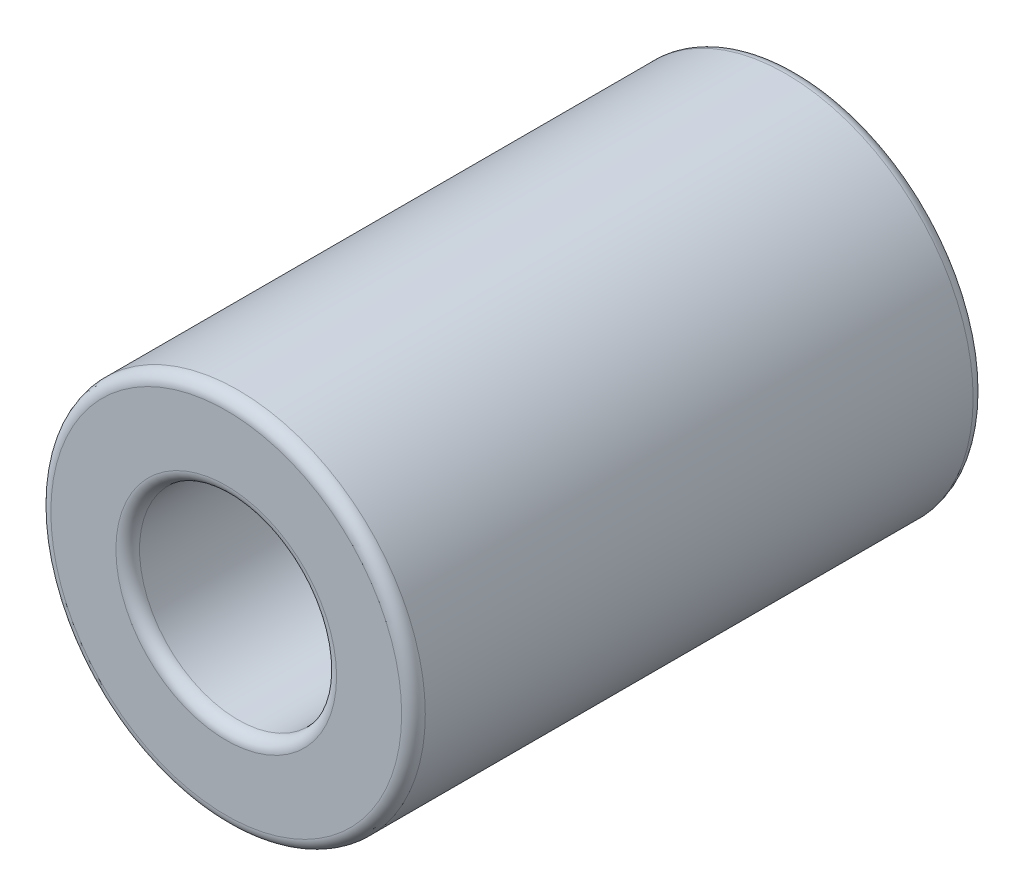
ISO-10303-21;
HEADER;
FILE_DESCRIPTION(('STEP AP214'),'2;1');
FILE_NAME('part.step','',(''),(''),'','','');
FILE_SCHEMA(('AUTOMOTIVE_DESIGN { 1 0 10303 214 1 1 1 1 }'));
ENDSEC;
DATA;
#1=APPLICATION_CONTEXT('core data for automotive mechanical design processes');
#2=APPLICATION_PROTOCOL_DEFINITION('international standard','automotive_design',2000,#1);
#3=PRODUCT_CONTEXT('',#1,'mechanical');
#4=PRODUCT('Part','Part','',(#3));
#5=PRODUCT_RELATED_PRODUCT_CATEGORY('part','',(#4));
#6=PRODUCT_DEFINITION_FORMATION('','',#4);
#7=PRODUCT_DEFINITION_CONTEXT('part definition',#1,'design');
#8=PRODUCT_DEFINITION('design','',#6,#7);
#9=PRODUCT_DEFINITION_SHAPE('','',#8);
#10=(LENGTH_UNIT() NAMED_UNIT(*) SI_UNIT(.MILLI.,.METRE.));
#11=(NAMED_UNIT(*) PLANE_ANGLE_UNIT() SI_UNIT($,.RADIAN.));
#12=(NAMED_UNIT(*) SI_UNIT($,.STERADIAN.) SOLID_ANGLE_UNIT());
#13=UNCERTAINTY_MEASURE_WITH_UNIT(LENGTH_MEASURE(1.E-05),#10,'distance_accuracy_value','');
#14=(GEOMETRIC_REPRESENTATION_CONTEXT(3) GLOBAL_UNCERTAINTY_ASSIGNED_CONTEXT((#13)) GLOBAL_UNIT_ASSIGNED_CONTEXT((#10,
#11,#12)) REPRESENTATION_CONTEXT('',''));
#15=CARTESIAN_POINT('',(0.,0.,0.));
#16=DIRECTION('',(0.,0.,1.));
#17=DIRECTION('',(1.,0.,0.));
#18=AXIS2_PLACEMENT_3D('',#15,#16,#17);
#19=CARTESIAN_POINT('',(0.,0.,29.));
#20=DIRECTION('',(0.,0.,1.));
#21=DIRECTION('',(1.,0.,0.));
#22=AXIS2_PLACEMENT_3D('',#19,#20,#21);
#23=PLANE('',#22);
#24=CARTESIAN_POINT('',(0.,0.,29.));
#25=DIRECTION('',(0.,0.,1.));
#26=DIRECTION('',(1.,0.,0.));
#27=AXIS2_PLACEMENT_3D('',#24,#25,#26);
#28=CIRCLE('',#27,5.6);
#29=CARTESIAN_POINT('',(5.6,0.,29.));
#30=VERTEX_POINT('',#29);
#31=EDGE_CURVE('E53',#30,#30,#28,.F.);
#32=ORIENTED_EDGE('',*,*,#31,.T.);
#33=EDGE_LOOP('',(#32));
#34=FACE_BOUND('',#33,.T.);
#35=CARTESIAN_POINT('',(0.,0.,29.));
#36=DIRECTION('',(0.,0.,1.));
#37=DIRECTION('',(1.,0.,0.));
#38=AXIS2_PLACEMENT_3D('',#35,#36,#37);
#39=CIRCLE('',#38,8.9);
#40=CARTESIAN_POINT('',(8.9,0.,29.));
#41=VERTEX_POINT('',#40);
#42=EDGE_CURVE('E56',#41,#41,#39,.T.);
#43=ORIENTED_EDGE('',*,*,#42,.T.);
#44=EDGE_LOOP('',(#43));
#45=FACE_BOUND('',#44,.T.);
#46=ADVANCED_FACE('F33',(#34,#45),#23,.T.);
#47=CARTESIAN_POINT('',(0.,0.,0.));
#48=DIRECTION('',(0.,0.,1.));
#49=DIRECTION('',(1.,0.,0.));
#50=AXIS2_PLACEMENT_3D('',#47,#48,#49);
#51=PLANE('',#50);
#52=CARTESIAN_POINT('',(0.,0.,0.));
#53=DIRECTION('',(0.,0.,1.));
#54=DIRECTION('',(1.,0.,0.));
#55=AXIS2_PLACEMENT_3D('',#52,#53,#54);
#56=CIRCLE('',#55,5.6);
#57=CARTESIAN_POINT('',(5.6,0.,0.));
#58=VERTEX_POINT('',#57);
#59=EDGE_CURVE('E44',#58,#58,#56,.T.);
#60=ORIENTED_EDGE('',*,*,#59,.T.);
#61=EDGE_LOOP('',(#60));
#62=FACE_BOUND('',#61,.T.);
#63=CARTESIAN_POINT('',(0.,0.,0.));
#64=DIRECTION('',(0.,0.,1.));
#65=DIRECTION('',(1.,0.,0.));
#66=AXIS2_PLACEMENT_3D('',#63,#64,#65);
#67=CIRCLE('',#66,8.9);
#68=CARTESIAN_POINT('',(8.9,0.,0.));
#69=VERTEX_POINT('',#68);
#70=EDGE_CURVE('E48',#69,#69,#67,.F.);
#71=ORIENTED_EDGE('',*,*,#70,.T.);
#72=EDGE_LOOP('',(#71));
#73=FACE_BOUND('',#72,.T.);
#74=ADVANCED_FACE('F76',(#62,#73),#51,.F.);
#75=CARTESIAN_POINT('',(0.,0.,29.));
#76=DIRECTION('',(0.,0.,-1.));
#77=DIRECTION('',(-1.,0.,0.));
#78=AXIS2_PLACEMENT_3D('',#75,#76,#77);
#79=CYLINDRICAL_SURFACE('',#78,9.5);
#80=CARTESIAN_POINT('',(0.,0.,0.6));
#81=DIRECTION('',(0.,0.,1.));
#82=DIRECTION('',(1.,0.,0.));
#83=AXIS2_PLACEMENT_3D('',#80,#81,#82);
#84=CIRCLE('',#83,9.5);
#85=CARTESIAN_POINT('',(9.5,0.,0.6));
#86=VERTEX_POINT('',#85);
#87=EDGE_CURVE('E10',#86,#86,#84,.T.);
#88=ORIENTED_EDGE('',*,*,#87,.T.);
#89=EDGE_LOOP('',(#88));
#90=FACE_BOUND('',#89,.T.);
#91=CARTESIAN_POINT('',(0.,0.,28.4));
#92=DIRECTION('',(0.,0.,1.));
#93=DIRECTION('',(1.,0.,0.));
#94=AXIS2_PLACEMENT_3D('',#91,#92,#93);
#95=CIRCLE('',#94,9.5);
#96=CARTESIAN_POINT('',(9.5,0.,28.4));
#97=VERTEX_POINT('',#96);
#98=EDGE_CURVE('E40',#97,#97,#95,.F.);
#99=ORIENTED_EDGE('',*,*,#98,.T.);
#100=EDGE_LOOP('',(#99));
#101=FACE_BOUND('',#100,.T.);
#102=ADVANCED_FACE('F79',(#90,#101),#79,.T.);
#103=CARTESIAN_POINT('',(0.,0.,29.));
#104=DIRECTION('',(0.,0.,-1.));
#105=DIRECTION('',(-1.,0.,0.));
#106=AXIS2_PLACEMENT_3D('',#103,#104,#105);
#107=CYLINDRICAL_SURFACE('',#106,5.);
#108=CARTESIAN_POINT('',(0.,0.,28.4));
#109=DIRECTION('',(0.,0.,1.));
#110=DIRECTION('',(1.,0.,0.));
#111=AXIS2_PLACEMENT_3D('',#108,#109,#110);
#112=CIRCLE('',#111,5.);
#113=CARTESIAN_POINT('',(5.,0.,28.4));
#114=VERTEX_POINT('',#113);
#115=EDGE_CURVE('E59',#114,#114,#112,.T.);
#116=ORIENTED_EDGE('',*,*,#115,.T.);
#117=EDGE_LOOP('',(#116));
#118=FACE_BOUND('',#117,.T.);
#119=CARTESIAN_POINT('',(0.,0.,0.6));
#120=DIRECTION('',(0.,0.,1.));
#121=DIRECTION('',(1.,0.,0.));
#122=AXIS2_PLACEMENT_3D('',#119,#120,#121);
#123=CIRCLE('',#122,5.);
#124=CARTESIAN_POINT('',(5.,0.,0.6));
#125=VERTEX_POINT('',#124);
#126=EDGE_CURVE('E62',#125,#125,#123,.F.);
#127=ORIENTED_EDGE('',*,*,#126,.T.);
#128=EDGE_LOOP('',(#127));
#129=FACE_BOUND('',#128,.T.);
#130=ADVANCED_FACE('F66',(#118,#129),#107,.F.);
#131=CARTESIAN_POINT('',(0.,0.,28.4));
#132=DIRECTION('',(0.,0.,1.));
#133=DIRECTION('',(1.,0.,0.));
#134=AXIS2_PLACEMENT_3D('',#131,#132,#133);
#135=TOROIDAL_SURFACE('',#134,5.6,0.6);
#136=ORIENTED_EDGE('',*,*,#31,.F.);
#137=EDGE_LOOP('',(#136));
#138=FACE_BOUND('',#137,.T.);
#139=ORIENTED_EDGE('',*,*,#115,.F.);
#140=EDGE_LOOP('',(#139));
#141=FACE_BOUND('',#140,.T.);
#142=ADVANCED_FACE('F72',(#138,#141),#135,.T.);
#143=CARTESIAN_POINT('',(0.,0.,0.6));
#144=DIRECTION('',(0.,0.,1.));
#145=DIRECTION('',(1.,0.,0.));
#146=AXIS2_PLACEMENT_3D('',#143,#144,#145);
#147=TOROIDAL_SURFACE('',#146,5.6,0.6);
#148=ORIENTED_EDGE('',*,*,#126,.F.);
#149=EDGE_LOOP('',(#148));
#150=FACE_BOUND('',#149,.T.);
#151=ORIENTED_EDGE('',*,*,#59,.F.);
#152=EDGE_LOOP('',(#151));
#153=FACE_BOUND('',#152,.T.);
#154=ADVANCED_FACE('F68',(#150,#153),#147,.T.);
#155=CARTESIAN_POINT('',(0.,0.,0.6));
#156=DIRECTION('',(0.,0.,1.));
#157=DIRECTION('',(1.,0.,0.));
#158=AXIS2_PLACEMENT_3D('',#155,#156,#157);
#159=TOROIDAL_SURFACE('',#158,8.9,0.6);
#160=ORIENTED_EDGE('',*,*,#70,.F.);
#161=EDGE_LOOP('',(#160));
#162=FACE_BOUND('',#161,.T.);
#163=ORIENTED_EDGE('',*,*,#87,.F.);
#164=EDGE_LOOP('',(#163));
#165=FACE_BOUND('',#164,.T.);
#166=ADVANCED_FACE('F71',(#162,#165),#159,.T.);
#167=CARTESIAN_POINT('',(0.,0.,28.4));
#168=DIRECTION('',(0.,0.,1.));
#169=DIRECTION('',(1.,0.,0.));
#170=AXIS2_PLACEMENT_3D('',#167,#168,#169);
#171=TOROIDAL_SURFACE('',#170,8.9,0.6);
#172=ORIENTED_EDGE('',*,*,#98,.F.);
#173=EDGE_LOOP('',(#172));
#174=FACE_BOUND('',#173,.T.);
#175=ORIENTED_EDGE('',*,*,#42,.F.);
#176=EDGE_LOOP('',(#175));
#177=FACE_BOUND('',#176,.T.);
#178=ADVANCED_FACE('F35',(#174,#177),#171,.T.);
#179=CLOSED_SHELL('',(#46,#74,#102,#130,#142,#154,#166,#178));
#180=MANIFOLD_SOLID_BREP('B2',#179);
#181=ADVANCED_BREP_SHAPE_REPRESENTATION('',(#18,#180),#14);
#182=SHAPE_DEFINITION_REPRESENTATION(#9,#181);
ENDSEC;
END-ISO-10303-21;
